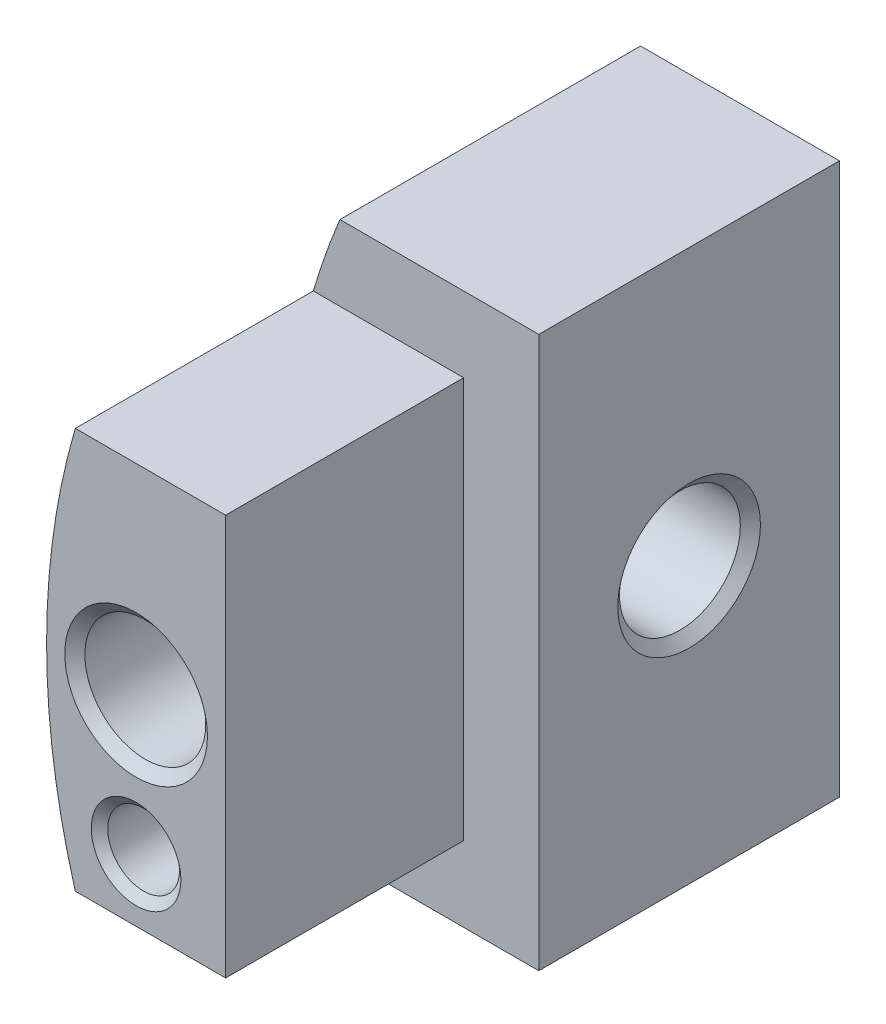
ISO-10303-21;
HEADER;
FILE_DESCRIPTION(('STEP AP214'),'2;1');
FILE_NAME('part.step','',(''),(''),'','','');
FILE_SCHEMA(('AUTOMOTIVE_DESIGN { 1 0 10303 214 1 1 1 1 }'));
ENDSEC;
DATA;
#1=APPLICATION_CONTEXT('core data for automotive mechanical design processes');
#2=APPLICATION_PROTOCOL_DEFINITION('international standard','automotive_design',2000,#1);
#3=PRODUCT_CONTEXT('',#1,'mechanical');
#4=PRODUCT('Part','Part','',(#3));
#5=PRODUCT_RELATED_PRODUCT_CATEGORY('part','',(#4));
#6=PRODUCT_DEFINITION_FORMATION('','',#4);
#7=PRODUCT_DEFINITION_CONTEXT('part definition',#1,'design');
#8=PRODUCT_DEFINITION('design','',#6,#7);
#9=PRODUCT_DEFINITION_SHAPE('','',#8);
#10=(LENGTH_UNIT() NAMED_UNIT(*) SI_UNIT(.MILLI.,.METRE.));
#11=(NAMED_UNIT(*) PLANE_ANGLE_UNIT() SI_UNIT($,.RADIAN.));
#12=(NAMED_UNIT(*) SI_UNIT($,.STERADIAN.) SOLID_ANGLE_UNIT());
#13=UNCERTAINTY_MEASURE_WITH_UNIT(LENGTH_MEASURE(1.E-05),#10,'distance_accuracy_value','');
#14=(GEOMETRIC_REPRESENTATION_CONTEXT(3) GLOBAL_UNCERTAINTY_ASSIGNED_CONTEXT((#13)) GLOBAL_UNIT_ASSIGNED_CONTEXT((#10,
#11,#12)) REPRESENTATION_CONTEXT('',''));
#15=CARTESIAN_POINT('',(0.,0.,0.));
#16=DIRECTION('',(0.,0.,1.));
#17=DIRECTION('',(1.,0.,0.));
#18=AXIS2_PLACEMENT_3D('',#15,#16,#17);
#19=CARTESIAN_POINT('',(0.,25.4,30.1625));
#20=DIRECTION('',(0.,1.,0.));
#21=DIRECTION('',(0.,0.,1.));
#22=AXIS2_PLACEMENT_3D('',#19,#20,#21);
#23=PLANE('',#22);
#24=DIRECTION('',(1.,0.,0.));
#25=VECTOR('',#24,1.);
#26=CARTESIAN_POINT('',(0.,25.4,0.));
#27=LINE('',#26,#25);
#28=CARTESIAN_POINT('',(-86.7832920325105,25.4,0.));
#29=VERTEX_POINT('',#28);
#30=CARTESIAN_POINT('',(-67.7332920325105,25.4,0.));
#31=VERTEX_POINT('',#30);
#32=EDGE_CURVE('E173',#29,#31,#27,.T.);
#33=ORIENTED_EDGE('',*,*,#32,.F.);
#34=DIRECTION('',(0.,0.,-1.));
#35=VECTOR('',#34,1.);
#36=CARTESIAN_POINT('',(-86.7832920325105,25.4,30.1625));
#37=LINE('',#36,#35);
#38=CARTESIAN_POINT('',(-86.7832920325105,25.4,30.1625));
#39=VERTEX_POINT('',#38);
#40=EDGE_CURVE('E91',#39,#29,#37,.T.);
#41=ORIENTED_EDGE('',*,*,#40,.F.);
#42=DIRECTION('',(1.,0.,0.));
#43=VECTOR('',#42,1.);
#44=CARTESIAN_POINT('',(0.,25.4,30.1625));
#45=LINE('',#44,#43);
#46=CARTESIAN_POINT('',(-67.7332920325105,25.4,30.1625));
#47=VERTEX_POINT('',#46);
#48=EDGE_CURVE('E168',#39,#47,#45,.T.);
#49=ORIENTED_EDGE('',*,*,#48,.T.);
#50=DIRECTION('',(0.,0.,-1.));
#51=VECTOR('',#50,1.);
#52=CARTESIAN_POINT('',(-67.7332920325105,25.4,30.1625));
#53=LINE('',#52,#51);
#54=EDGE_CURVE('E72',#47,#31,#53,.T.);
#55=ORIENTED_EDGE('',*,*,#54,.T.);
#56=EDGE_LOOP('',(#33,#41,#49,#55));
#57=FACE_BOUND('',#56,.T.);
#58=ADVANCED_FACE('F45',(#57),#23,.T.);
#59=CARTESIAN_POINT('',(0.,0.,30.1625));
#60=DIRECTION('',(0.,0.,-1.));
#61=DIRECTION('',(-1.,0.,0.));
#62=AXIS2_PLACEMENT_3D('',#59,#60,#61);
#63=CYLINDRICAL_SURFACE('',#62,90.424);
#64=ORIENTED_EDGE('',*,*,#40,.T.);
#65=CARTESIAN_POINT('',(0.,0.,0.));
#66=DIRECTION('',(0.,0.,1.));
#67=DIRECTION('',(1.,0.,0.));
#68=AXIS2_PLACEMENT_3D('',#65,#66,#67);
#69=CIRCLE('',#68,90.424);
#70=CARTESIAN_POINT('',(-83.407098924492,34.925,0.));
#71=VERTEX_POINT('',#70);
#72=EDGE_CURVE('E212',#71,#29,#69,.T.);
#73=ORIENTED_EDGE('',*,*,#72,.F.);
#74=DIRECTION('',(0.,0.,1.));
#75=VECTOR('',#74,1.);
#76=CARTESIAN_POINT('',(-83.407098924492,34.925,-38.1));
#77=LINE('',#76,#75);
#78=CARTESIAN_POINT('',(-83.407098924492,34.925,-38.1));
#79=VERTEX_POINT('',#78);
#80=EDGE_CURVE('E189',#79,#71,#77,.T.);
#81=ORIENTED_EDGE('',*,*,#80,.F.);
#82=CARTESIAN_POINT('',(0.,0.,-38.1));
#83=DIRECTION('',(0.,0.,1.));
#84=DIRECTION('',(1.,0.,0.));
#85=AXIS2_PLACEMENT_3D('',#82,#83,#84);
#86=CIRCLE('',#85,90.424);
#87=CARTESIAN_POINT('',(-83.407098924492,-34.925,-38.1));
#88=VERTEX_POINT('',#87);
#89=EDGE_CURVE('E227',#79,#88,#86,.T.);
#90=ORIENTED_EDGE('',*,*,#89,.T.);
#91=DIRECTION('',(0.,0.,1.));
#92=VECTOR('',#91,1.);
#93=CARTESIAN_POINT('',(-83.407098924492,-34.925,-38.1));
#94=LINE('',#93,#92);
#95=CARTESIAN_POINT('',(-83.407098924492,-34.925,0.));
#96=VERTEX_POINT('',#95);
#97=EDGE_CURVE('E192',#88,#96,#94,.T.);
#98=ORIENTED_EDGE('',*,*,#97,.T.);
#99=CARTESIAN_POINT('',(-86.7832920325105,-25.4,0.));
#100=VERTEX_POINT('',#99);
#101=EDGE_CURVE('E216',#100,#96,#69,.T.);
#102=ORIENTED_EDGE('',*,*,#101,.F.);
#103=DIRECTION('',(0.,0.,-1.));
#104=VECTOR('',#103,1.);
#105=CARTESIAN_POINT('',(-86.7832920325105,-25.4,30.1625));
#106=LINE('',#105,#104);
#107=CARTESIAN_POINT('',(-86.7832920325105,-25.4,30.1625));
#108=VERTEX_POINT('',#107);
#109=EDGE_CURVE('E155',#108,#100,#106,.T.);
#110=ORIENTED_EDGE('',*,*,#109,.F.);
#111=CARTESIAN_POINT('',(0.,0.,30.1625));
#112=DIRECTION('',(0.,0.,1.));
#113=DIRECTION('',(1.,0.,0.));
#114=AXIS2_PLACEMENT_3D('',#111,#112,#113);
#115=CIRCLE('',#114,90.424);
#116=EDGE_CURVE('E184',#39,#108,#115,.T.);
#117=ORIENTED_EDGE('',*,*,#116,.F.);
#118=EDGE_LOOP('',(#64,#73,#81,#90,#98,#102,#110,#117));
#119=FACE_BOUND('',#118,.T.);
#120=ADVANCED_FACE('F329',(#119),#63,.T.);
#121=CARTESIAN_POINT('',(0.,-25.4,30.1625));
#122=DIRECTION('',(0.,-1.,0.));
#123=DIRECTION('',(0.,0.,-1.));
#124=AXIS2_PLACEMENT_3D('',#121,#122,#123);
#125=PLANE('',#124);
#126=DIRECTION('',(-1.,0.,0.));
#127=VECTOR('',#126,1.);
#128=CARTESIAN_POINT('',(0.,-25.4,0.));
#129=LINE('',#128,#127);
#130=CARTESIAN_POINT('',(-67.7332920325105,-25.4,0.));
#131=VERTEX_POINT('',#130);
#132=EDGE_CURVE('E169',#131,#100,#129,.T.);
#133=ORIENTED_EDGE('',*,*,#132,.F.);
#134=DIRECTION('',(0.,0.,-1.));
#135=VECTOR('',#134,1.);
#136=CARTESIAN_POINT('',(-67.7332920325105,-25.4,30.1625));
#137=LINE('',#136,#135);
#138=CARTESIAN_POINT('',(-67.7332920325105,-25.4,30.1625));
#139=VERTEX_POINT('',#138);
#140=EDGE_CURVE('E158',#139,#131,#137,.T.);
#141=ORIENTED_EDGE('',*,*,#140,.F.);
#142=DIRECTION('',(-1.,0.,0.));
#143=VECTOR('',#142,1.);
#144=CARTESIAN_POINT('',(0.,-25.4,30.1625));
#145=LINE('',#144,#143);
#146=EDGE_CURVE('E180',#139,#108,#145,.T.);
#147=ORIENTED_EDGE('',*,*,#146,.T.);
#148=ORIENTED_EDGE('',*,*,#109,.T.);
#149=EDGE_LOOP('',(#133,#141,#147,#148));
#150=FACE_BOUND('',#149,.T.);
#151=ADVANCED_FACE('F327',(#150),#125,.T.);
#152=CARTESIAN_POINT('',(-67.7332920325105,0.,30.1625));
#153=DIRECTION('',(1.,0.,0.));
#154=DIRECTION('',(0.,0.,-1.));
#155=AXIS2_PLACEMENT_3D('',#152,#153,#154);
#156=PLANE('',#155);
#157=DIRECTION('',(0.,-1.,0.));
#158=VECTOR('',#157,1.);
#159=CARTESIAN_POINT('',(-67.7332920325105,0.,0.));
#160=LINE('',#159,#158);
#161=EDGE_CURVE('E164',#31,#131,#160,.T.);
#162=ORIENTED_EDGE('',*,*,#161,.F.);
#163=ORIENTED_EDGE('',*,*,#54,.F.);
#164=DIRECTION('',(0.,-1.,0.));
#165=VECTOR('',#164,1.);
#166=CARTESIAN_POINT('',(-67.7332920325105,0.,30.1625));
#167=LINE('',#166,#165);
#168=EDGE_CURVE('E163',#47,#139,#167,.T.);
#169=ORIENTED_EDGE('',*,*,#168,.T.);
#170=ORIENTED_EDGE('',*,*,#140,.T.);
#171=EDGE_LOOP('',(#162,#163,#169,#170));
#172=FACE_BOUND('',#171,.T.);
#173=ADVANCED_FACE('F323',(#172),#156,.T.);
#174=CARTESIAN_POINT('',(0.,0.,30.1625));
#175=DIRECTION('',(0.,0.,1.));
#176=DIRECTION('',(1.,0.,0.));
#177=AXIS2_PLACEMENT_3D('',#174,#175,#176);
#178=PLANE('',#177);
#179=CARTESIAN_POINT('',(-79.0786460162553,-17.4625,30.1625));
#180=DIRECTION('',(0.,0.,1.));
#181=DIRECTION('',(1.,0.,0.));
#182=AXIS2_PLACEMENT_3D('',#179,#180,#181);
#183=CIRCLE('',#182,5.6769);
#184=CARTESIAN_POINT('',(-73.4017460162553,-17.4625,30.1625));
#185=VERTEX_POINT('',#184);
#186=EDGE_CURVE('E253',#185,#185,#183,.T.);
#187=ORIENTED_EDGE('',*,*,#186,.F.);
#188=EDGE_LOOP('',(#187));
#189=FACE_BOUND('',#188,.T.);
#190=CARTESIAN_POINT('',(-79.0786460162553,0.,30.1625));
#191=DIRECTION('',(0.,0.,1.));
#192=DIRECTION('',(1.,0.,0.));
#193=AXIS2_PLACEMENT_3D('',#190,#191,#192);
#194=CIRCLE('',#193,9.04239999999999);
#195=CARTESIAN_POINT('',(-70.0362460162553,0.,30.1625));
#196=VERTEX_POINT('',#195);
#197=EDGE_CURVE('E241',#196,#196,#194,.T.);
#198=ORIENTED_EDGE('',*,*,#197,.F.);
#199=EDGE_LOOP('',(#198));
#200=FACE_BOUND('',#199,.T.);
#201=ORIENTED_EDGE('',*,*,#48,.F.);
#202=ORIENTED_EDGE('',*,*,#116,.T.);
#203=ORIENTED_EDGE('',*,*,#146,.F.);
#204=ORIENTED_EDGE('',*,*,#168,.F.);
#205=EDGE_LOOP('',(#201,#202,#203,#204));
#206=FACE_BOUND('',#205,.T.);
#207=ADVANCED_FACE('F319',(#189,#200,#206),#178,.T.);
#208=CARTESIAN_POINT('',(0.,34.925,-38.1));
#209=DIRECTION('',(0.,-1.,0.));
#210=DIRECTION('',(0.,0.,-1.));
#211=AXIS2_PLACEMENT_3D('',#208,#209,#210);
#212=PLANE('',#211);
#213=DIRECTION('',(1.,0.,0.));
#214=VECTOR('',#213,1.);
#215=CARTESIAN_POINT('',(0.,34.925,0.));
#216=LINE('',#215,#214);
#217=CARTESIAN_POINT('',(-58.2082920325105,34.925,0.));
#218=VERTEX_POINT('',#217);
#219=EDGE_CURVE('E217',#71,#218,#216,.T.);
#220=ORIENTED_EDGE('',*,*,#219,.T.);
#221=DIRECTION('',(0.,0.,1.));
#222=VECTOR('',#221,1.);
#223=CARTESIAN_POINT('',(-58.2082920325105,34.925,-38.1));
#224=LINE('',#223,#222);
#225=CARTESIAN_POINT('',(-58.2082920325105,34.925,-38.1));
#226=VERTEX_POINT('',#225);
#227=EDGE_CURVE('E177',#226,#218,#224,.T.);
#228=ORIENTED_EDGE('',*,*,#227,.F.);
#229=DIRECTION('',(1.,0.,0.));
#230=VECTOR('',#229,1.);
#231=CARTESIAN_POINT('',(0.,34.925,-38.1));
#232=LINE('',#231,#230);
#233=EDGE_CURVE('E207',#79,#226,#232,.T.);
#234=ORIENTED_EDGE('',*,*,#233,.F.);
#235=ORIENTED_EDGE('',*,*,#80,.T.);
#236=EDGE_LOOP('',(#220,#228,#234,#235));
#237=FACE_BOUND('',#236,.T.);
#238=ADVANCED_FACE('F312',(#237),#212,.F.);
#239=CARTESIAN_POINT('',(-58.2082920325105,0.,-38.1));
#240=DIRECTION('',(-1.,0.,0.));
#241=DIRECTION('',(0.,-1.,0.));
#242=AXIS2_PLACEMENT_3D('',#239,#240,#241);
#243=PLANE('',#242);
#244=CARTESIAN_POINT('',(-58.2082920325105,0.,-19.05));
#245=DIRECTION('',(1.,0.,0.));
#246=DIRECTION('',(0.,0.,-1.));
#247=AXIS2_PLACEMENT_3D('',#244,#245,#246);
#248=CIRCLE('',#247,9.0424);
#249=CARTESIAN_POINT('',(-58.2082920325105,0.,-28.0924));
#250=VERTEX_POINT('',#249);
#251=EDGE_CURVE('E354',#250,#250,#248,.T.);
#252=ORIENTED_EDGE('',*,*,#251,.F.);
#253=EDGE_LOOP('',(#252));
#254=FACE_BOUND('',#253,.T.);
#255=DIRECTION('',(0.,-1.,0.));
#256=VECTOR('',#255,1.);
#257=CARTESIAN_POINT('',(-58.2082920325105,0.,0.));
#258=LINE('',#257,#256);
#259=CARTESIAN_POINT('',(-58.2082920325105,-34.925,0.));
#260=VERTEX_POINT('',#259);
#261=EDGE_CURVE('E204',#218,#260,#258,.T.);
#262=ORIENTED_EDGE('',*,*,#261,.T.);
#263=DIRECTION('',(0.,0.,1.));
#264=VECTOR('',#263,1.);
#265=CARTESIAN_POINT('',(-58.2082920325105,-34.925,-38.1));
#266=LINE('',#265,#264);
#267=CARTESIAN_POINT('',(-58.2082920325105,-34.925,-38.1));
#268=VERTEX_POINT('',#267);
#269=EDGE_CURVE('E197',#268,#260,#266,.T.);
#270=ORIENTED_EDGE('',*,*,#269,.F.);
#271=DIRECTION('',(0.,-1.,0.));
#272=VECTOR('',#271,1.);
#273=CARTESIAN_POINT('',(-58.2082920325105,0.,-38.1));
#274=LINE('',#273,#272);
#275=EDGE_CURVE('E193',#226,#268,#274,.T.);
#276=ORIENTED_EDGE('',*,*,#275,.F.);
#277=ORIENTED_EDGE('',*,*,#227,.T.);
#278=EDGE_LOOP('',(#262,#270,#276,#277));
#279=FACE_BOUND('',#278,.T.);
#280=ADVANCED_FACE('F309',(#254,#279),#243,.F.);
#281=CARTESIAN_POINT('',(0.,-34.925,-38.1));
#282=DIRECTION('',(0.,1.,0.));
#283=DIRECTION('',(0.,0.,1.));
#284=AXIS2_PLACEMENT_3D('',#281,#282,#283);
#285=PLANE('',#284);
#286=DIRECTION('',(-1.,0.,0.));
#287=VECTOR('',#286,1.);
#288=CARTESIAN_POINT('',(0.,-34.925,0.));
#289=LINE('',#288,#287);
#290=EDGE_CURVE('E208',#260,#96,#289,.T.);
#291=ORIENTED_EDGE('',*,*,#290,.T.);
#292=ORIENTED_EDGE('',*,*,#97,.F.);
#293=DIRECTION('',(-1.,0.,0.));
#294=VECTOR('',#293,1.);
#295=CARTESIAN_POINT('',(0.,-34.925,-38.1));
#296=LINE('',#295,#294);
#297=EDGE_CURVE('E224',#268,#88,#296,.T.);
#298=ORIENTED_EDGE('',*,*,#297,.F.);
#299=ORIENTED_EDGE('',*,*,#269,.T.);
#300=EDGE_LOOP('',(#291,#292,#298,#299));
#301=FACE_BOUND('',#300,.T.);
#302=ADVANCED_FACE('F304',(#301),#285,.F.);
#303=CARTESIAN_POINT('',(0.,0.,-38.1));
#304=DIRECTION('',(0.,0.,1.));
#305=DIRECTION('',(1.,0.,0.));
#306=AXIS2_PLACEMENT_3D('',#303,#304,#305);
#307=PLANE('',#306);
#308=CARTESIAN_POINT('',(-79.0786460162553,-17.4625,-38.1));
#309=DIRECTION('',(0.,0.,1.));
#310=DIRECTION('',(1.,0.,0.));
#311=AXIS2_PLACEMENT_3D('',#308,#309,#310);
#312=CIRCLE('',#311,4.54659999999998);
#313=CARTESIAN_POINT('',(-74.5320460162553,-17.4625,-38.1));
#314=VERTEX_POINT('',#313);
#315=EDGE_CURVE('E245',#314,#314,#312,.T.);
#316=ORIENTED_EDGE('',*,*,#315,.T.);
#317=EDGE_LOOP('',(#316));
#318=FACE_BOUND('',#317,.T.);
#319=ORIENTED_EDGE('',*,*,#233,.T.);
#320=ORIENTED_EDGE('',*,*,#275,.T.);
#321=ORIENTED_EDGE('',*,*,#297,.T.);
#322=ORIENTED_EDGE('',*,*,#89,.F.);
#323=EDGE_LOOP('',(#319,#320,#321,#322));
#324=FACE_BOUND('',#323,.T.);
#325=ADVANCED_FACE('F301',(#318,#324),#307,.F.);
#326=CARTESIAN_POINT('',(0.,0.,0.));
#327=DIRECTION('',(0.,0.,1.));
#328=DIRECTION('',(1.,0.,0.));
#329=AXIS2_PLACEMENT_3D('',#326,#327,#328);
#330=PLANE('',#329);
#331=ORIENTED_EDGE('',*,*,#72,.T.);
#332=ORIENTED_EDGE('',*,*,#32,.T.);
#333=ORIENTED_EDGE('',*,*,#161,.T.);
#334=ORIENTED_EDGE('',*,*,#132,.T.);
#335=ORIENTED_EDGE('',*,*,#101,.T.);
#336=ORIENTED_EDGE('',*,*,#290,.F.);
#337=ORIENTED_EDGE('',*,*,#261,.F.);
#338=ORIENTED_EDGE('',*,*,#219,.F.);
#339=EDGE_LOOP('',(#331,#332,#333,#334,#335,#336,#337,#338));
#340=FACE_BOUND('',#339,.T.);
#341=ADVANCED_FACE('F299',(#340),#330,.T.);
#342=CARTESIAN_POINT('',(-79.0786460162553,0.,-28.736049293425));
#343=DIRECTION('',(0.,0.,1.));
#344=DIRECTION('',(1.,0.,0.));
#345=AXIS2_PLACEMENT_3D('',#342,#343,#344);
#346=CONICAL_SURFACE('',#345,7.65809999999999,1.02974425867665);
#347=CARTESIAN_POINT('',(-79.0786460162553,0.,-33.3375));
#348=VERTEX_POINT('',#347);
#349=VERTEX_LOOP('',#348);
#350=FACE_BOUND('',#349,.T.);
#351=CARTESIAN_POINT('',(-79.0786460162553,0.,-28.736049293425));
#352=DIRECTION('',(0.,0.,1.));
#353=DIRECTION('',(1.,0.,0.));
#354=AXIS2_PLACEMENT_3D('',#351,#352,#353);
#355=CIRCLE('',#354,7.65809999999999);
#356=CARTESIAN_POINT('',(-71.4205460162553,0.,-28.736049293425));
#357=VERTEX_POINT('',#356);
#358=EDGE_CURVE('E221',#357,#357,#355,.T.);
#359=ORIENTED_EDGE('',*,*,#358,.T.);
#360=EDGE_LOOP('',(#359));
#361=FACE_BOUND('',#360,.T.);
#362=ADVANCED_FACE('F295',(#350,#361),#346,.F.);
#363=CARTESIAN_POINT('',(-79.0786460162553,0.,30.1625));
#364=DIRECTION('',(0.,0.,1.));
#365=DIRECTION('',(1.,0.,0.));
#366=AXIS2_PLACEMENT_3D('',#363,#364,#365);
#367=CYLINDRICAL_SURFACE('',#366,7.65809999999999);
#368=CARTESIAN_POINT('',(-79.0786460162553,0.,-19.05));
#369=DIRECTION('',(-0.707106781186547,0.,0.707106781186547));
#370=DIRECTION('',(0.707106781186547,0.,0.707106781186547));
#371=AXIS2_PLACEMENT_3D('',#368,#369,#370);
#372=ELLIPSE('',#371,10.8301888820094,7.65809999999999);
#373=CARTESIAN_POINT('',(-79.0068413259356,7.6577633612203,-18.9781953096812));
#374=VERTEX_POINT('',#373);
#375=CARTESIAN_POINT('',(-79.0068413259356,-7.65776336122029,-18.9781953096795));
#376=VERTEX_POINT('',#375);
#377=EDGE_CURVE('E63',#374,#376,#372,.F.);
#378=ORIENTED_EDGE('',*,*,#377,.T.);
#379=CARTESIAN_POINT('',(-79.0068413259356,-7.65776336122029,-18.9781953096803));
#380=DIRECTION('',(0.,0.,-1.));
#381=VECTOR('',#380,1.);
#382=LINE('',#379,#381);
#383=CARTESIAN_POINT('',(-79.0068413259356,-7.65776336122029,-19.1218046903205));
#384=VERTEX_POINT('',#383);
#385=EDGE_CURVE('E11',#376,#384,#382,.T.);
#386=ORIENTED_EDGE('',*,*,#385,.T.);
#387=CARTESIAN_POINT('',(-79.0786460162553,0.,-19.05));
#388=DIRECTION('',(0.707106781186547,0.,0.707106781186547));
#389=DIRECTION('',(-0.707106781186547,0.,0.707106781186547));
#390=AXIS2_PLACEMENT_3D('',#387,#388,#389);
#391=ELLIPSE('',#390,10.8301888820094,7.65809999999999);
#392=CARTESIAN_POINT('',(-79.0068413259356,7.6577633612203,-19.1218046903188));
#393=VERTEX_POINT('',#392);
#394=EDGE_CURVE('E56',#384,#393,#391,.T.);
#395=ORIENTED_EDGE('',*,*,#394,.T.);
#396=CARTESIAN_POINT('',(-79.0068413259356,7.6577633612203,-19.1218046903188));
#397=DIRECTION('',(0.,0.,1.));
#398=VECTOR('',#397,1.);
#399=LINE('',#396,#398);
#400=EDGE_CURVE('E130',#393,#374,#399,.T.);
#401=ORIENTED_EDGE('',*,*,#400,.T.);
#402=EDGE_LOOP('',(#378,#386,#395,#401));
#403=FACE_BOUND('',#402,.T.);
#404=ORIENTED_EDGE('',*,*,#358,.F.);
#405=EDGE_LOOP('',(#404));
#406=FACE_BOUND('',#405,.T.);
#407=CARTESIAN_POINT('',(-79.0786460162553,0.,29.0009343805613));
#408=DIRECTION('',(0.,0.,1.));
#409=DIRECTION('',(1.,0.,0.));
#410=AXIS2_PLACEMENT_3D('',#407,#408,#409);
#411=CIRCLE('',#410,7.6581);
#412=CARTESIAN_POINT('',(-71.4205460162553,0.,29.0009343805613));
#413=VERTEX_POINT('',#412);
#414=EDGE_CURVE('E237',#413,#413,#411,.T.);
#415=ORIENTED_EDGE('',*,*,#414,.T.);
#416=EDGE_LOOP('',(#415));
#417=FACE_BOUND('',#416,.T.);
#418=ADVANCED_FACE('F139',(#403,#406,#417),#367,.F.);
#419=CARTESIAN_POINT('',(-79.0786460162553,0.,30.1625));
#420=DIRECTION('',(0.,0.,1.));
#421=DIRECTION('',(1.,0.,0.));
#422=AXIS2_PLACEMENT_3D('',#419,#420,#421);
#423=CONICAL_SURFACE('',#422,9.04239999999999,0.87266462599716);
#424=ORIENTED_EDGE('',*,*,#414,.F.);
#425=EDGE_LOOP('',(#424));
#426=FACE_BOUND('',#425,.T.);
#427=ORIENTED_EDGE('',*,*,#197,.T.);
#428=EDGE_LOOP('',(#427));
#429=FACE_BOUND('',#428,.T.);
#430=ADVANCED_FACE('F288',(#426,#429),#423,.F.);
#431=CARTESIAN_POINT('',(-79.0786460162553,-17.4625,30.1625));
#432=DIRECTION('',(0.,0.,1.));
#433=DIRECTION('',(1.,0.,0.));
#434=AXIS2_PLACEMENT_3D('',#431,#432,#433);
#435=CYLINDRICAL_SURFACE('',#434,4.54659999999999);
#436=ORIENTED_EDGE('',*,*,#315,.F.);
#437=EDGE_LOOP('',(#436));
#438=FACE_BOUND('',#437,.T.);
#439=CARTESIAN_POINT('',(-79.0786460162553,-17.4625,29.2140656868803));
#440=DIRECTION('',(0.,0.,1.));
#441=DIRECTION('',(1.,0.,0.));
#442=AXIS2_PLACEMENT_3D('',#439,#440,#441);
#443=CIRCLE('',#442,4.5466);
#444=CARTESIAN_POINT('',(-74.5320460162553,-17.4625,29.2140656868803));
#445=VERTEX_POINT('',#444);
#446=EDGE_CURVE('E249',#445,#445,#443,.T.);
#447=ORIENTED_EDGE('',*,*,#446,.T.);
#448=EDGE_LOOP('',(#447));
#449=FACE_BOUND('',#448,.T.);
#450=ADVANCED_FACE('F284',(#438,#449),#435,.F.);
#451=CARTESIAN_POINT('',(-79.0786460162553,-17.4625,30.1625));
#452=DIRECTION('',(0.,0.,1.));
#453=DIRECTION('',(1.,0.,0.));
#454=AXIS2_PLACEMENT_3D('',#451,#452,#453);
#455=CONICAL_SURFACE('',#454,5.6769,0.872664625997164);
#456=ORIENTED_EDGE('',*,*,#446,.F.);
#457=EDGE_LOOP('',(#456));
#458=FACE_BOUND('',#457,.T.);
#459=ORIENTED_EDGE('',*,*,#186,.T.);
#460=EDGE_LOOP('',(#459));
#461=FACE_BOUND('',#460,.T.);
#462=ADVANCED_FACE('F272',(#458,#461),#455,.F.);
#463=CARTESIAN_POINT('',(-58.2082920325105,0.,-19.05));
#464=DIRECTION('',(1.,0.,0.));
#465=DIRECTION('',(0.,0.,-1.));
#466=AXIS2_PLACEMENT_3D('',#463,#464,#465);
#467=CYLINDRICAL_SURFACE('',#466,7.65809999999999);
#468=CARTESIAN_POINT('',(-59.3698576519492,0.,-19.05));
#469=DIRECTION('',(1.,0.,0.));
#470=DIRECTION('',(0.,0.,-1.));
#471=AXIS2_PLACEMENT_3D('',#468,#469,#470);
#472=CIRCLE('',#471,7.65809999999999);
#473=CARTESIAN_POINT('',(-59.3698576519492,0.,-26.7081));
#474=VERTEX_POINT('',#473);
#475=EDGE_CURVE('E257',#474,#474,#472,.T.);
#476=ORIENTED_EDGE('',*,*,#475,.T.);
#477=EDGE_LOOP('',(#476));
#478=FACE_BOUND('',#477,.T.);
#479=ORIENTED_EDGE('',*,*,#385,.F.);
#480=ORIENTED_EDGE('',*,*,#377,.F.);
#481=ORIENTED_EDGE('',*,*,#400,.F.);
#482=ORIENTED_EDGE('',*,*,#394,.F.);
#483=EDGE_LOOP('',(#479,#480,#481,#482));
#484=FACE_BOUND('',#483,.T.);
#485=ADVANCED_FACE('F133',(#478,#484),#467,.F.);
#486=CARTESIAN_POINT('',(-58.2082920325105,0.,-19.05));
#487=DIRECTION('',(1.,0.,0.));
#488=DIRECTION('',(0.,0.,-1.));
#489=AXIS2_PLACEMENT_3D('',#486,#487,#488);
#490=CONICAL_SURFACE('',#489,9.0424,0.872664625997163);
#491=ORIENTED_EDGE('',*,*,#475,.F.);
#492=EDGE_LOOP('',(#491));
#493=FACE_BOUND('',#492,.T.);
#494=ORIENTED_EDGE('',*,*,#251,.T.);
#495=EDGE_LOOP('',(#494));
#496=FACE_BOUND('',#495,.T.);
#497=ADVANCED_FACE('F271',(#493,#496),#490,.F.);
#498=CLOSED_SHELL('',(#58,#120,#151,#173,#207,#238,#280,#302,#325,#341,#362,#418,#430,#450,#462,
#485,#497));
#499=MANIFOLD_SOLID_BREP('B2',#498);
#500=ADVANCED_BREP_SHAPE_REPRESENTATION('',(#18,#499),#14);
#501=SHAPE_DEFINITION_REPRESENTATION(#9,#500);
ENDSEC;
END-ISO-10303-21;
